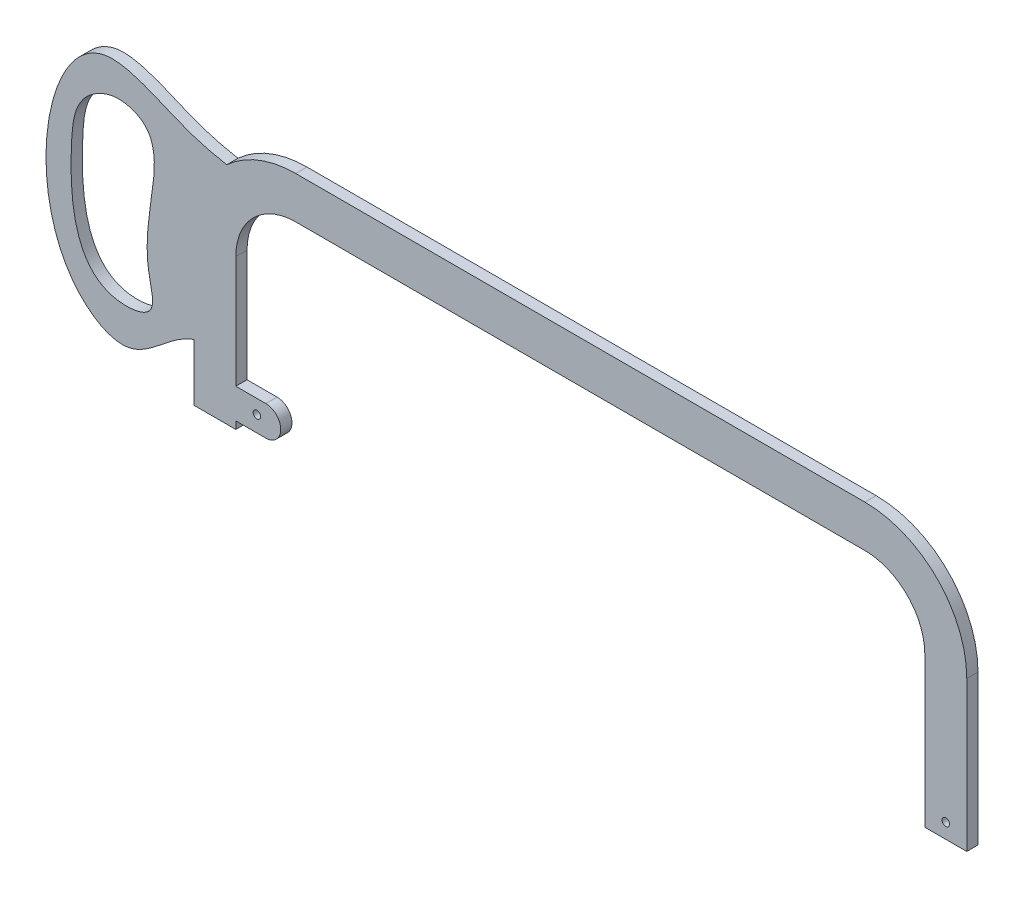
ISO-10303-21;
HEADER;
FILE_DESCRIPTION(('STEP AP214'),'2;1');
FILE_NAME('part.step','',(''),(''),'','','');
FILE_SCHEMA(('AUTOMOTIVE_DESIGN { 1 0 10303 214 1 1 1 1 }'));
ENDSEC;
DATA;
#1=APPLICATION_CONTEXT('core data for automotive mechanical design processes');
#2=APPLICATION_PROTOCOL_DEFINITION('international standard','automotive_design',2000,#1);
#3=PRODUCT_CONTEXT('',#1,'mechanical');
#4=PRODUCT('Part','Part','',(#3));
#5=PRODUCT_RELATED_PRODUCT_CATEGORY('part','',(#4));
#6=PRODUCT_DEFINITION_FORMATION('','',#4);
#7=PRODUCT_DEFINITION_CONTEXT('part definition',#1,'design');
#8=PRODUCT_DEFINITION('design','',#6,#7);
#9=PRODUCT_DEFINITION_SHAPE('','',#8);
#10=(LENGTH_UNIT() NAMED_UNIT(*) SI_UNIT(.MILLI.,.METRE.));
#11=(NAMED_UNIT(*) PLANE_ANGLE_UNIT() SI_UNIT($,.RADIAN.));
#12=(NAMED_UNIT(*) SI_UNIT($,.STERADIAN.) SOLID_ANGLE_UNIT());
#13=UNCERTAINTY_MEASURE_WITH_UNIT(LENGTH_MEASURE(1.E-05),#10,'distance_accuracy_value','');
#14=(GEOMETRIC_REPRESENTATION_CONTEXT(3) GLOBAL_UNCERTAINTY_ASSIGNED_CONTEXT((#13)) GLOBAL_UNIT_ASSIGNED_CONTEXT((#10,
#11,#12)) REPRESENTATION_CONTEXT('',''));
#15=CARTESIAN_POINT('',(0.,0.,0.));
#16=DIRECTION('',(0.,0.,1.));
#17=DIRECTION('',(1.,0.,0.));
#18=AXIS2_PLACEMENT_3D('',#15,#16,#17);
#19=CARTESIAN_POINT('',(-176.252817460317,0.,2.38125));
#20=DIRECTION('',(-1.,0.,0.));
#21=DIRECTION('',(0.,-1.,0.));
#22=AXIS2_PLACEMENT_3D('',#19,#20,#21);
#23=PLANE('',#22);
#24=DIRECTION('',(0.,1.,0.));
#25=VECTOR('',#24,1.);
#26=CARTESIAN_POINT('',(-176.252817460317,0.,-2.38125));
#27=LINE('',#26,#25);
#28=CARTESIAN_POINT('',(-176.252817460317,0.,-2.38125));
#29=VERTEX_POINT('',#28);
#30=CARTESIAN_POINT('',(-176.252817460317,3.175,-2.38125));
#31=VERTEX_POINT('',#30);
#32=EDGE_CURVE('E277',#29,#31,#27,.T.);
#33=ORIENTED_EDGE('',*,*,#32,.T.);
#34=DIRECTION('',(0.,0.,1.));
#35=VECTOR('',#34,1.);
#36=CARTESIAN_POINT('',(-176.252817460317,3.175,-25.2765005991963));
#37=LINE('',#36,#35);
#38=CARTESIAN_POINT('',(-176.252817460317,3.175,2.38125));
#39=VERTEX_POINT('',#38);
#40=EDGE_CURVE('E280',#31,#39,#37,.T.);
#41=ORIENTED_EDGE('',*,*,#40,.T.);
#42=DIRECTION('',(0.,1.,0.));
#43=VECTOR('',#42,1.);
#44=CARTESIAN_POINT('',(-176.252817460317,0.,2.38125));
#45=LINE('',#44,#43);
#46=CARTESIAN_POINT('',(-176.252817460317,0.,2.38125));
#47=VERTEX_POINT('',#46);
#48=EDGE_CURVE('E325',#47,#39,#45,.T.);
#49=ORIENTED_EDGE('',*,*,#48,.F.);
#50=DIRECTION('',(0.,0.,-1.));
#51=VECTOR('',#50,1.);
#52=CARTESIAN_POINT('',(-176.252817460317,0.,2.38125));
#53=LINE('',#52,#51);
#54=EDGE_CURVE('E11',#47,#29,#53,.T.);
#55=ORIENTED_EDGE('',*,*,#54,.T.);
#56=EDGE_LOOP('',(#33,#41,#49,#55));
#57=FACE_BOUND('',#56,.T.);
#58=ADVANCED_FACE('F32',(#57),#23,.F.);
#59=CARTESIAN_POINT('',(-194.032817460317,0.,2.38125));
#60=DIRECTION('',(0.,1.,0.));
#61=DIRECTION('',(0.,0.,1.));
#62=AXIS2_PLACEMENT_3D('',#59,#60,#61);
#63=PLANE('',#62);
#64=DIRECTION('',(1.,0.,0.));
#65=VECTOR('',#64,1.);
#66=CARTESIAN_POINT('',(-194.032817460317,0.,-2.38125));
#67=LINE('',#66,#65);
#68=CARTESIAN_POINT('',(-194.032817460317,0.,-2.38125));
#69=VERTEX_POINT('',#68);
#70=EDGE_CURVE('E160',#69,#29,#67,.T.);
#71=ORIENTED_EDGE('',*,*,#70,.T.);
#72=ORIENTED_EDGE('',*,*,#54,.F.);
#73=DIRECTION('',(1.,0.,0.));
#74=VECTOR('',#73,1.);
#75=CARTESIAN_POINT('',(-194.032817460317,0.,2.38125));
#76=LINE('',#75,#74);
#77=CARTESIAN_POINT('',(-194.032817460317,0.,2.38125));
#78=VERTEX_POINT('',#77);
#79=EDGE_CURVE('E162',#78,#47,#76,.T.);
#80=ORIENTED_EDGE('',*,*,#79,.F.);
#81=DIRECTION('',(0.,0.,-1.));
#82=VECTOR('',#81,1.);
#83=CARTESIAN_POINT('',(-194.032817460317,0.,2.38125));
#84=LINE('',#83,#82);
#85=EDGE_CURVE('E346',#78,#69,#84,.T.);
#86=ORIENTED_EDGE('',*,*,#85,.T.);
#87=EDGE_LOOP('',(#71,#72,#80,#86));
#88=FACE_BOUND('',#87,.T.);
#89=ADVANCED_FACE('F34',(#88),#63,.F.);
#90=CARTESIAN_POINT('',(-176.252817460317,15.875,2.38125));
#91=VERTEX_POINT('',#90);
#92=CARTESIAN_POINT('',(-176.252817460317,63.5,2.38125));
#93=VERTEX_POINT('',#92);
#94=EDGE_CURVE('E324',#91,#93,#45,.T.);
#95=ORIENTED_EDGE('',*,*,#94,.F.);
#96=DIRECTION('',(0.,0.,1.));
#97=VECTOR('',#96,1.);
#98=CARTESIAN_POINT('',(-176.252817460317,15.875,-25.2765005991963));
#99=LINE('',#98,#97);
#100=CARTESIAN_POINT('',(-176.252817460317,15.875,-2.38125));
#101=VERTEX_POINT('',#100);
#102=EDGE_CURVE('E297',#101,#91,#99,.T.);
#103=ORIENTED_EDGE('',*,*,#102,.F.);
#104=CARTESIAN_POINT('',(-176.252817460317,63.5,-2.38125));
#105=VERTEX_POINT('',#104);
#106=EDGE_CURVE('E284',#101,#105,#27,.T.);
#107=ORIENTED_EDGE('',*,*,#106,.T.);
#108=DIRECTION('',(0.,0.,-1.));
#109=VECTOR('',#108,1.);
#110=CARTESIAN_POINT('',(-176.252817460317,63.5,2.38125));
#111=LINE('',#110,#109);
#112=EDGE_CURVE('E40',#93,#105,#111,.T.);
#113=ORIENTED_EDGE('',*,*,#112,.F.);
#114=EDGE_LOOP('',(#95,#103,#107,#113));
#115=FACE_BOUND('',#114,.T.);
#116=ADVANCED_FACE('F265',(#115),#23,.F.);
#117=CARTESIAN_POINT('',(-150.852817460317,63.5,2.38125));
#118=DIRECTION('',(0.,0.,-1.));
#119=DIRECTION('',(-1.,0.,0.));
#120=AXIS2_PLACEMENT_3D('',#117,#118,#119);
#121=CYLINDRICAL_SURFACE('',#120,25.4);
#122=CARTESIAN_POINT('',(-150.852817460317,63.5,-2.38125));
#123=DIRECTION('',(0.,0.,-1.));
#124=DIRECTION('',(-1.,0.,0.));
#125=AXIS2_PLACEMENT_3D('',#122,#123,#124);
#126=CIRCLE('',#125,25.4);
#127=CARTESIAN_POINT('',(-150.852817460317,88.9,-2.38125));
#128=VERTEX_POINT('',#127);
#129=EDGE_CURVE('E283',#105,#128,#126,.T.);
#130=ORIENTED_EDGE('',*,*,#129,.T.);
#131=DIRECTION('',(0.,0.,-1.));
#132=VECTOR('',#131,1.);
#133=CARTESIAN_POINT('',(-150.852817460317,88.9,2.38125));
#134=LINE('',#133,#132);
#135=CARTESIAN_POINT('',(-150.852817460317,88.9,2.38125));
#136=VERTEX_POINT('',#135);
#137=EDGE_CURVE('E369',#136,#128,#134,.T.);
#138=ORIENTED_EDGE('',*,*,#137,.F.);
#139=CARTESIAN_POINT('',(-150.852817460317,63.5,2.38125));
#140=DIRECTION('',(0.,0.,-1.));
#141=DIRECTION('',(-1.,0.,0.));
#142=AXIS2_PLACEMENT_3D('',#139,#140,#141);
#143=CIRCLE('',#142,25.4);
#144=EDGE_CURVE('E327',#93,#136,#143,.T.);
#145=ORIENTED_EDGE('',*,*,#144,.F.);
#146=ORIENTED_EDGE('',*,*,#112,.T.);
#147=EDGE_LOOP('',(#130,#138,#145,#146));
#148=FACE_BOUND('',#147,.T.);
#149=ADVANCED_FACE('F262',(#148),#121,.F.);
#150=CARTESIAN_POINT('',(-150.852817460317,88.9,2.38125));
#151=DIRECTION('',(0.,1.,0.));
#152=DIRECTION('',(-1.,0.,0.));
#153=AXIS2_PLACEMENT_3D('',#150,#151,#152);
#154=PLANE('',#153);
#155=DIRECTION('',(1.,0.,0.));
#156=VECTOR('',#155,1.);
#157=CARTESIAN_POINT('',(-150.852817460317,88.9,-2.38125));
#158=LINE('',#157,#156);
#159=CARTESIAN_POINT('',(90.4471825396825,88.9,-2.38125));
#160=VERTEX_POINT('',#159);
#161=EDGE_CURVE('E307',#128,#160,#158,.T.);
#162=ORIENTED_EDGE('',*,*,#161,.T.);
#163=DIRECTION('',(0.,0.,-1.));
#164=VECTOR('',#163,1.);
#165=CARTESIAN_POINT('',(90.4471825396825,88.9,2.38125));
#166=LINE('',#165,#164);
#167=CARTESIAN_POINT('',(90.4471825396825,88.9,2.38125));
#168=VERTEX_POINT('',#167);
#169=EDGE_CURVE('E366',#168,#160,#166,.T.);
#170=ORIENTED_EDGE('',*,*,#169,.F.);
#171=DIRECTION('',(1.,0.,0.));
#172=VECTOR('',#171,1.);
#173=CARTESIAN_POINT('',(-150.852817460317,88.9,2.38125));
#174=LINE('',#173,#172);
#175=EDGE_CURVE('E329',#136,#168,#174,.T.);
#176=ORIENTED_EDGE('',*,*,#175,.F.);
#177=ORIENTED_EDGE('',*,*,#137,.T.);
#178=EDGE_LOOP('',(#162,#170,#176,#177));
#179=FACE_BOUND('',#178,.T.);
#180=ADVANCED_FACE('F258',(#179),#154,.F.);
#181=CARTESIAN_POINT('',(90.4471825396825,63.5,2.38125));
#182=DIRECTION('',(0.,0.,-1.));
#183=DIRECTION('',(-1.,0.,0.));
#184=AXIS2_PLACEMENT_3D('',#181,#182,#183);
#185=CYLINDRICAL_SURFACE('',#184,25.4);
#186=CARTESIAN_POINT('',(90.4471825396825,63.5,-2.38125));
#187=DIRECTION('',(0.,0.,-1.));
#188=DIRECTION('',(1.,0.,0.));
#189=AXIS2_PLACEMENT_3D('',#186,#187,#188);
#190=CIRCLE('',#189,25.4);
#191=CARTESIAN_POINT('',(115.847182539683,63.5,-2.38125));
#192=VERTEX_POINT('',#191);
#193=EDGE_CURVE('E309',#160,#192,#190,.T.);
#194=ORIENTED_EDGE('',*,*,#193,.T.);
#195=DIRECTION('',(0.,0.,-1.));
#196=VECTOR('',#195,1.);
#197=CARTESIAN_POINT('',(115.847182539683,63.5,2.38125));
#198=LINE('',#197,#196);
#199=CARTESIAN_POINT('',(115.847182539683,63.5,2.38125));
#200=VERTEX_POINT('',#199);
#201=EDGE_CURVE('E363',#200,#192,#198,.T.);
#202=ORIENTED_EDGE('',*,*,#201,.F.);
#203=CARTESIAN_POINT('',(90.4471825396825,63.5,2.38125));
#204=DIRECTION('',(0.,0.,-1.));
#205=DIRECTION('',(1.,0.,0.));
#206=AXIS2_PLACEMENT_3D('',#203,#204,#205);
#207=CIRCLE('',#206,25.4);
#208=EDGE_CURVE('E331',#168,#200,#207,.T.);
#209=ORIENTED_EDGE('',*,*,#208,.F.);
#210=ORIENTED_EDGE('',*,*,#169,.T.);
#211=EDGE_LOOP('',(#194,#202,#209,#210));
#212=FACE_BOUND('',#211,.T.);
#213=ADVANCED_FACE('F254',(#212),#185,.F.);
#214=CARTESIAN_POINT('',(115.847182539683,63.5,2.38125));
#215=DIRECTION('',(1.,0.,0.));
#216=DIRECTION('',(0.,0.,-1.));
#217=AXIS2_PLACEMENT_3D('',#214,#215,#216);
#218=PLANE('',#217);
#219=DIRECTION('',(0.,-1.,0.));
#220=VECTOR('',#219,1.);
#221=CARTESIAN_POINT('',(115.847182539683,63.5,-2.38125));
#222=LINE('',#221,#220);
#223=CARTESIAN_POINT('',(115.847182539683,0.,-2.38125));
#224=VERTEX_POINT('',#223);
#225=EDGE_CURVE('E311',#192,#224,#222,.T.);
#226=ORIENTED_EDGE('',*,*,#225,.T.);
#227=DIRECTION('',(0.,0.,-1.));
#228=VECTOR('',#227,1.);
#229=CARTESIAN_POINT('',(115.847182539683,0.,2.38125));
#230=LINE('',#229,#228);
#231=CARTESIAN_POINT('',(115.847182539683,0.,2.38125));
#232=VERTEX_POINT('',#231);
#233=EDGE_CURVE('E360',#232,#224,#230,.T.);
#234=ORIENTED_EDGE('',*,*,#233,.F.);
#235=DIRECTION('',(0.,-1.,0.));
#236=VECTOR('',#235,1.);
#237=CARTESIAN_POINT('',(115.847182539683,63.5,2.38125));
#238=LINE('',#237,#236);
#239=EDGE_CURVE('E333',#200,#232,#238,.T.);
#240=ORIENTED_EDGE('',*,*,#239,.F.);
#241=ORIENTED_EDGE('',*,*,#201,.T.);
#242=EDGE_LOOP('',(#226,#234,#240,#241));
#243=FACE_BOUND('',#242,.T.);
#244=ADVANCED_FACE('F250',(#243),#218,.F.);
#245=CARTESIAN_POINT('',(115.847182539683,0.,2.38125));
#246=DIRECTION('',(0.,1.,0.));
#247=DIRECTION('',(0.,0.,1.));
#248=AXIS2_PLACEMENT_3D('',#245,#246,#247);
#249=PLANE('',#248);
#250=DIRECTION('',(1.,0.,0.));
#251=VECTOR('',#250,1.);
#252=CARTESIAN_POINT('',(115.847182539683,0.,-2.38125));
#253=LINE('',#252,#251);
#254=CARTESIAN_POINT('',(133.627182539683,0.,-2.38125));
#255=VERTEX_POINT('',#254);
#256=EDGE_CURVE('E313',#224,#255,#253,.T.);
#257=ORIENTED_EDGE('',*,*,#256,.T.);
#258=DIRECTION('',(0.,0.,-1.));
#259=VECTOR('',#258,1.);
#260=CARTESIAN_POINT('',(133.627182539683,0.,2.38125));
#261=LINE('',#260,#259);
#262=CARTESIAN_POINT('',(133.627182539683,0.,2.38125));
#263=VERTEX_POINT('',#262);
#264=EDGE_CURVE('E357',#263,#255,#261,.T.);
#265=ORIENTED_EDGE('',*,*,#264,.F.);
#266=DIRECTION('',(1.,0.,0.));
#267=VECTOR('',#266,1.);
#268=CARTESIAN_POINT('',(115.847182539683,0.,2.38125));
#269=LINE('',#268,#267);
#270=EDGE_CURVE('E335',#232,#263,#269,.T.);
#271=ORIENTED_EDGE('',*,*,#270,.F.);
#272=ORIENTED_EDGE('',*,*,#233,.T.);
#273=EDGE_LOOP('',(#257,#265,#271,#272));
#274=FACE_BOUND('',#273,.T.);
#275=ADVANCED_FACE('F246',(#274),#249,.F.);
#276=CARTESIAN_POINT('',(133.627182539683,0.,2.38125));
#277=DIRECTION('',(-1.,0.,0.));
#278=DIRECTION('',(0.,0.,1.));
#279=AXIS2_PLACEMENT_3D('',#276,#277,#278);
#280=PLANE('',#279);
#281=DIRECTION('',(0.,1.,0.));
#282=VECTOR('',#281,1.);
#283=CARTESIAN_POINT('',(133.627182539683,0.,-2.38125));
#284=LINE('',#283,#282);
#285=CARTESIAN_POINT('',(133.627182539683,63.5,-2.38125));
#286=VERTEX_POINT('',#285);
#287=EDGE_CURVE('E315',#255,#286,#284,.T.);
#288=ORIENTED_EDGE('',*,*,#287,.T.);
#289=DIRECTION('',(0.,0.,-1.));
#290=VECTOR('',#289,1.);
#291=CARTESIAN_POINT('',(133.627182539683,63.5,2.38125));
#292=LINE('',#291,#290);
#293=CARTESIAN_POINT('',(133.627182539683,63.5,2.38125));
#294=VERTEX_POINT('',#293);
#295=EDGE_CURVE('E354',#294,#286,#292,.T.);
#296=ORIENTED_EDGE('',*,*,#295,.F.);
#297=DIRECTION('',(0.,1.,0.));
#298=VECTOR('',#297,1.);
#299=CARTESIAN_POINT('',(133.627182539683,0.,2.38125));
#300=LINE('',#299,#298);
#301=EDGE_CURVE('E337',#263,#294,#300,.T.);
#302=ORIENTED_EDGE('',*,*,#301,.F.);
#303=ORIENTED_EDGE('',*,*,#264,.T.);
#304=EDGE_LOOP('',(#288,#296,#302,#303));
#305=FACE_BOUND('',#304,.T.);
#306=ADVANCED_FACE('F242',(#305),#280,.F.);
#307=CARTESIAN_POINT('',(90.4471825396825,63.5,2.38125));
#308=DIRECTION('',(0.,0.,-1.));
#309=DIRECTION('',(-1.,0.,0.));
#310=AXIS2_PLACEMENT_3D('',#307,#308,#309);
#311=CYLINDRICAL_SURFACE('',#310,43.18);
#312=CARTESIAN_POINT('',(90.4471825396825,63.5,-2.38125));
#313=DIRECTION('',(0.,0.,1.));
#314=DIRECTION('',(1.,0.,0.));
#315=AXIS2_PLACEMENT_3D('',#312,#313,#314);
#316=CIRCLE('',#315,43.18);
#317=CARTESIAN_POINT('',(90.4471825396825,106.68,-2.38125));
#318=VERTEX_POINT('',#317);
#319=EDGE_CURVE('E317',#286,#318,#316,.T.);
#320=ORIENTED_EDGE('',*,*,#319,.T.);
#321=DIRECTION('',(0.,0.,-1.));
#322=VECTOR('',#321,1.);
#323=CARTESIAN_POINT('',(90.4471825396825,106.68,2.38125));
#324=LINE('',#323,#322);
#325=CARTESIAN_POINT('',(90.4471825396825,106.68,2.38125));
#326=VERTEX_POINT('',#325);
#327=EDGE_CURVE('E351',#326,#318,#324,.T.);
#328=ORIENTED_EDGE('',*,*,#327,.F.);
#329=CARTESIAN_POINT('',(90.4471825396825,63.5,2.38125));
#330=DIRECTION('',(0.,0.,1.));
#331=DIRECTION('',(1.,0.,0.));
#332=AXIS2_PLACEMENT_3D('',#329,#330,#331);
#333=CIRCLE('',#332,43.18);
#334=EDGE_CURVE('E339',#294,#326,#333,.T.);
#335=ORIENTED_EDGE('',*,*,#334,.F.);
#336=ORIENTED_EDGE('',*,*,#295,.T.);
#337=EDGE_LOOP('',(#320,#328,#335,#336));
#338=FACE_BOUND('',#337,.T.);
#339=ADVANCED_FACE('F238',(#338),#311,.T.);
#340=CARTESIAN_POINT('',(90.4471825396825,106.68,2.38125));
#341=DIRECTION('',(0.,-1.,0.));
#342=DIRECTION('',(1.,0.,0.));
#343=AXIS2_PLACEMENT_3D('',#340,#341,#342);
#344=PLANE('',#343);
#345=DIRECTION('',(-1.,0.,0.));
#346=VECTOR('',#345,1.);
#347=CARTESIAN_POINT('',(90.4471825396825,106.68,-2.38125));
#348=LINE('',#347,#346);
#349=CARTESIAN_POINT('',(-150.852817460317,106.68,-2.38125));
#350=VERTEX_POINT('',#349);
#351=EDGE_CURVE('E319',#318,#350,#348,.T.);
#352=ORIENTED_EDGE('',*,*,#351,.T.);
#353=DIRECTION('',(0.,0.,-1.));
#354=VECTOR('',#353,1.);
#355=CARTESIAN_POINT('',(-150.852817460317,106.68,2.38125));
#356=LINE('',#355,#354);
#357=CARTESIAN_POINT('',(-150.852817460317,106.68,2.38125));
#358=VERTEX_POINT('',#357);
#359=EDGE_CURVE('E348',#358,#350,#356,.T.);
#360=ORIENTED_EDGE('',*,*,#359,.F.);
#361=DIRECTION('',(-1.,0.,0.));
#362=VECTOR('',#361,1.);
#363=CARTESIAN_POINT('',(90.4471825396825,106.68,2.38125));
#364=LINE('',#363,#362);
#365=EDGE_CURVE('E341',#326,#358,#364,.T.);
#366=ORIENTED_EDGE('',*,*,#365,.F.);
#367=ORIENTED_EDGE('',*,*,#327,.T.);
#368=EDGE_LOOP('',(#352,#360,#366,#367));
#369=FACE_BOUND('',#368,.T.);
#370=ADVANCED_FACE('F235',(#369),#344,.F.);
#371=CARTESIAN_POINT('',(-150.852817460317,63.5,2.38125));
#372=DIRECTION('',(0.,0.,-1.));
#373=DIRECTION('',(-1.,0.,0.));
#374=AXIS2_PLACEMENT_3D('',#371,#372,#373);
#375=CYLINDRICAL_SURFACE('',#374,43.18);
#376=CARTESIAN_POINT('',(-150.852817460317,63.5,-2.38125));
#377=DIRECTION('',(0.,0.,1.));
#378=DIRECTION('',(-1.,0.,0.));
#379=AXIS2_PLACEMENT_3D('',#376,#377,#378);
#380=CIRCLE('',#379,43.18);
#381=CARTESIAN_POINT('',(-180.094894680852,95.2712656315155,-2.38125));
#382=VERTEX_POINT('',#381);
#383=EDGE_CURVE('E163',#350,#382,#380,.T.);
#384=ORIENTED_EDGE('',*,*,#383,.T.);
#385=DIRECTION('',(0.,0.,1.));
#386=VECTOR('',#385,1.);
#387=CARTESIAN_POINT('',(-180.094894680852,95.2712656315155,0.));
#388=LINE('',#387,#386);
#389=CARTESIAN_POINT('',(-180.094894680852,95.2712656315155,2.38125));
#390=VERTEX_POINT('',#389);
#391=EDGE_CURVE('E55',#382,#390,#388,.T.);
#392=ORIENTED_EDGE('',*,*,#391,.T.);
#393=CARTESIAN_POINT('',(-150.852817460317,63.5,2.38125));
#394=DIRECTION('',(0.,0.,1.));
#395=DIRECTION('',(-1.,0.,0.));
#396=AXIS2_PLACEMENT_3D('',#393,#394,#395);
#397=CIRCLE('',#396,43.18);
#398=EDGE_CURVE('E343',#358,#390,#397,.T.);
#399=ORIENTED_EDGE('',*,*,#398,.F.);
#400=ORIENTED_EDGE('',*,*,#359,.T.);
#401=EDGE_LOOP('',(#384,#392,#399,#400));
#402=FACE_BOUND('',#401,.T.);
#403=ADVANCED_FACE('F232',(#402),#375,.T.);
#404=CARTESIAN_POINT('',(-194.032817460317,63.5,2.38125));
#405=DIRECTION('',(1.,0.,0.));
#406=DIRECTION('',(0.,1.,0.));
#407=AXIS2_PLACEMENT_3D('',#404,#405,#406);
#408=PLANE('',#407);
#409=DIRECTION('',(0.,-1.,0.));
#410=VECTOR('',#409,1.);
#411=CARTESIAN_POINT('',(-194.032817460317,63.5,2.38125));
#412=LINE('',#411,#410);
#413=CARTESIAN_POINT('',(-194.032817460317,24.1205061199108,2.38125));
#414=VERTEX_POINT('',#413);
#415=EDGE_CURVE('E47',#414,#78,#412,.T.);
#416=ORIENTED_EDGE('',*,*,#415,.F.);
#417=DIRECTION('',(0.,0.,1.));
#418=VECTOR('',#417,1.);
#419=CARTESIAN_POINT('',(-194.032817460317,24.1205061199112,0.));
#420=LINE('',#419,#418);
#421=CARTESIAN_POINT('',(-194.032817460319,24.1205061199108,-2.38125));
#422=VERTEX_POINT('',#421);
#423=EDGE_CURVE('E165',#414,#422,#420,.F.);
#424=ORIENTED_EDGE('',*,*,#423,.T.);
#425=DIRECTION('',(0.,-1.,0.));
#426=VECTOR('',#425,1.);
#427=CARTESIAN_POINT('',(-194.032817460317,63.5,-2.38125));
#428=LINE('',#427,#426);
#429=EDGE_CURVE('E153',#422,#69,#428,.T.);
#430=ORIENTED_EDGE('',*,*,#429,.T.);
#431=ORIENTED_EDGE('',*,*,#85,.F.);
#432=EDGE_LOOP('',(#416,#424,#430,#431));
#433=FACE_BOUND('',#432,.T.);
#434=ADVANCED_FACE('F166',(#433),#408,.F.);
#435=CARTESIAN_POINT('',(-150.852817460317,63.5,2.38125));
#436=DIRECTION('',(0.,0.,-1.));
#437=DIRECTION('',(-1.,0.,0.));
#438=AXIS2_PLACEMENT_3D('',#435,#436,#437);
#439=PLANE('',#438);
#440=ORIENTED_EDGE('',*,*,#398,.T.);
#441=CARTESIAN_POINT('',(-163.50008603373,92.9767178813179,2.38125));
#442=CARTESIAN_POINT('',(-174.215818284095,94.2300992189467,2.38125));
#443=CARTESIAN_POINT('',(-196.776448036714,96.8689363638482,2.38125));
#444=CARTESIAN_POINT('',(-252.859222163881,130.124714633944,2.38125));
#445=CARTESIAN_POINT('',(-269.426470803475,29.793267068146,2.38125));
#446=CARTESIAN_POINT('',(-217.090656666542,-1.29085573981712,2.38125));
#447=CARTESIAN_POINT('',(-200.757769768453,26.3378115151783,2.38125));
#448=CARTESIAN_POINT('',(-186.899721404846,24.7198097405488,2.38125));
#449=CARTESIAN_POINT('',(-185.37100561647,24.541323939836,2.38125));
#450=B_SPLINE_CURVE_WITH_KNOTS('',3,(#441,#442,#443,#444,#445,#446,#447,#448,#449),
.UNSPECIFIED.,.F.,.F.,(4,1,1,1,1,1,4),(0.,0.145421676533469,0.306167093916027,0.711218283048218,
0.818840041352885,0.980015794306756,1.),.UNSPECIFIED.);
#451=EDGE_CURVE('E176',#390,#414,#450,.T.);
#452=ORIENTED_EDGE('',*,*,#451,.T.);
#453=ORIENTED_EDGE('',*,*,#415,.T.);
#454=ORIENTED_EDGE('',*,*,#79,.T.);
#455=ORIENTED_EDGE('',*,*,#48,.T.);
#456=DIRECTION('',(1.,0.,0.));
#457=VECTOR('',#456,1.);
#458=CARTESIAN_POINT('',(-176.252817460317,3.175,2.38125));
#459=LINE('',#458,#457);
#460=CARTESIAN_POINT('',(-163.552817460317,3.175,2.38125));
#461=VERTEX_POINT('',#460);
#462=EDGE_CURVE('E296',#39,#461,#459,.T.);
#463=ORIENTED_EDGE('',*,*,#462,.T.);
#464=CARTESIAN_POINT('',(-163.552817460317,9.525,2.38125));
#465=DIRECTION('',(0.,0.,1.));
#466=DIRECTION('',(1.,0.,0.));
#467=AXIS2_PLACEMENT_3D('',#464,#465,#466);
#468=CIRCLE('',#467,6.35);
#469=CARTESIAN_POINT('',(-163.552817460317,15.875,2.38125));
#470=VERTEX_POINT('',#469);
#471=EDGE_CURVE('E397',#461,#470,#468,.T.);
#472=ORIENTED_EDGE('',*,*,#471,.T.);
#473=DIRECTION('',(-1.,0.,0.));
#474=VECTOR('',#473,1.);
#475=CARTESIAN_POINT('',(-176.252817460317,15.875,2.38125));
#476=LINE('',#475,#474);
#477=EDGE_CURVE('E292',#470,#91,#476,.T.);
#478=ORIENTED_EDGE('',*,*,#477,.T.);
#479=ORIENTED_EDGE('',*,*,#94,.T.);
#480=ORIENTED_EDGE('',*,*,#144,.T.);
#481=ORIENTED_EDGE('',*,*,#175,.T.);
#482=ORIENTED_EDGE('',*,*,#208,.T.);
#483=ORIENTED_EDGE('',*,*,#239,.T.);
#484=ORIENTED_EDGE('',*,*,#270,.T.);
#485=ORIENTED_EDGE('',*,*,#301,.T.);
#486=ORIENTED_EDGE('',*,*,#334,.T.);
#487=ORIENTED_EDGE('',*,*,#365,.T.);
#488=EDGE_LOOP('',(#440,#452,#453,#454,#455,#463,#472,#478,#479,#480,#481,#482,#483,#484,#485,
#486,#487));
#489=FACE_BOUND('',#488,.T.);
#490=CARTESIAN_POINT('',(124.737182539683,6.35,2.38125));
#491=DIRECTION('',(0.,0.,1.));
#492=DIRECTION('',(1.,0.,0.));
#493=AXIS2_PLACEMENT_3D('',#490,#491,#492);
#494=CIRCLE('',#493,1.58749999999997);
#495=CARTESIAN_POINT('',(126.324682539683,6.35,2.38125));
#496=VERTEX_POINT('',#495);
#497=EDGE_CURVE('E410',#496,#496,#494,.T.);
#498=ORIENTED_EDGE('',*,*,#497,.F.);
#499=EDGE_LOOP('',(#498));
#500=FACE_BOUND('',#499,.T.);
#501=CARTESIAN_POINT('',(-167.336278270076,9.93855216538009,2.38125));
#502=DIRECTION('',(0.,0.,1.));
#503=DIRECTION('',(1.,0.,0.));
#504=AXIS2_PLACEMENT_3D('',#501,#502,#503);
#505=CIRCLE('',#504,1.58749999999999);
#506=CARTESIAN_POINT('',(-165.748778270076,9.93855216538009,2.38125));
#507=VERTEX_POINT('',#506);
#508=EDGE_CURVE('E401',#507,#507,#505,.T.);
#509=ORIENTED_EDGE('',*,*,#508,.F.);
#510=EDGE_LOOP('',(#509));
#511=FACE_BOUND('',#510,.T.);
#512=CARTESIAN_POINT('',(-241.011953679969,88.8094623745175,2.38125));
#513=CARTESIAN_POINT('',(-244.988611476123,83.6487410239102,2.38125));
#514=CARTESIAN_POINT('',(-247.283551881555,60.1055409584341,2.38125));
#515=CARTESIAN_POINT('',(-244.915722390433,18.8537352838272,2.38125));
#516=CARTESIAN_POINT('',(-208.081682807615,23.1237234693048,2.38125));
#517=CARTESIAN_POINT('',(-220.297957576784,55.3931547391515,2.38125));
#518=CARTESIAN_POINT('',(-201.095560901441,90.7405361068269,2.38125));
#519=CARTESIAN_POINT('',(-229.023756485265,98.1268585883008,2.38125));
#520=CARTESIAN_POINT('',(-237.642234652288,93.1825268480365,2.38125));
#521=CARTESIAN_POINT('',(-241.011953679969,88.8094623745175,2.38125));
#522=B_SPLINE_CURVE_WITH_KNOTS('',3,(#512,#513,#514,#515,#516,#517,#518,#519,#520,#521),
.UNSPECIFIED.,.T.,.F.,(4,1,1,1,1,1,1,4),(0.,0.110817881329757,0.392381603405073,
0.47396519666166,0.559095552804665,0.859488043987518,0.906095736051165,1.),.UNSPECIFIED.);
#523=CARTESIAN_POINT('',(-241.011953679969,88.8094623745175,2.38125));
#524=VERTEX_POINT('',#523);
#525=EDGE_CURVE('E173',#524,#524,#522,.T.);
#526=ORIENTED_EDGE('',*,*,#525,.F.);
#527=EDGE_LOOP('',(#526));
#528=FACE_BOUND('',#527,.T.);
#529=ADVANCED_FACE('F226',(#489,#500,#511,#528),#439,.F.);
#530=CARTESIAN_POINT('',(-150.852817460317,63.5,-2.38125));
#531=DIRECTION('',(0.,0.,-1.));
#532=DIRECTION('',(-1.,0.,0.));
#533=AXIS2_PLACEMENT_3D('',#530,#531,#532);
#534=PLANE('',#533);
#535=ORIENTED_EDGE('',*,*,#429,.F.);
#536=CARTESIAN_POINT('',(-163.50008603373,92.9767178813179,-2.38125));
#537=CARTESIAN_POINT('',(-174.215818284095,94.2300992189467,-2.38125));
#538=CARTESIAN_POINT('',(-196.776448036714,96.8689363638482,-2.38125));
#539=CARTESIAN_POINT('',(-252.859222163881,130.124714633944,-2.38125));
#540=CARTESIAN_POINT('',(-269.426470803475,29.793267068146,-2.38125));
#541=CARTESIAN_POINT('',(-217.090656666542,-1.29085573981712,-2.38125));
#542=CARTESIAN_POINT('',(-200.757769768453,26.3378115151783,-2.38125));
#543=CARTESIAN_POINT('',(-186.899721404846,24.7198097405488,-2.38125));
#544=CARTESIAN_POINT('',(-185.37100561647,24.541323939836,-2.38125));
#545=B_SPLINE_CURVE_WITH_KNOTS('',3,(#536,#537,#538,#539,#540,#541,#542,#543,#544),
.UNSPECIFIED.,.F.,.F.,(4,1,1,1,1,1,4),(0.,0.145421676533469,0.306167093916027,0.711218283048218,
0.818840041352885,0.980015794306756,1.),.UNSPECIFIED.);
#546=EDGE_CURVE('E158',#382,#422,#545,.T.);
#547=ORIENTED_EDGE('',*,*,#546,.F.);
#548=ORIENTED_EDGE('',*,*,#383,.F.);
#549=ORIENTED_EDGE('',*,*,#351,.F.);
#550=ORIENTED_EDGE('',*,*,#319,.F.);
#551=ORIENTED_EDGE('',*,*,#287,.F.);
#552=ORIENTED_EDGE('',*,*,#256,.F.);
#553=ORIENTED_EDGE('',*,*,#225,.F.);
#554=ORIENTED_EDGE('',*,*,#193,.F.);
#555=ORIENTED_EDGE('',*,*,#161,.F.);
#556=ORIENTED_EDGE('',*,*,#129,.F.);
#557=ORIENTED_EDGE('',*,*,#106,.F.);
#558=DIRECTION('',(-1.,0.,0.));
#559=VECTOR('',#558,1.);
#560=CARTESIAN_POINT('',(-176.252817460317,15.875,-2.38125));
#561=LINE('',#560,#559);
#562=CARTESIAN_POINT('',(-163.552817460317,15.875,-2.38125));
#563=VERTEX_POINT('',#562);
#564=EDGE_CURVE('E301',#563,#101,#561,.T.);
#565=ORIENTED_EDGE('',*,*,#564,.F.);
#566=CARTESIAN_POINT('',(-163.552817460317,9.525,-2.38125));
#567=DIRECTION('',(0.,0.,-1.));
#568=DIRECTION('',(-1.,0.,0.));
#569=AXIS2_PLACEMENT_3D('',#566,#567,#568);
#570=CIRCLE('',#569,6.35);
#571=CARTESIAN_POINT('',(-163.552817460317,3.175,-2.38125));
#572=VERTEX_POINT('',#571);
#573=EDGE_CURVE('E289',#572,#563,#570,.F.);
#574=ORIENTED_EDGE('',*,*,#573,.F.);
#575=DIRECTION('',(1.,0.,0.));
#576=VECTOR('',#575,1.);
#577=CARTESIAN_POINT('',(-176.252817460317,3.175,-2.38125));
#578=LINE('',#577,#576);
#579=EDGE_CURVE('E287',#31,#572,#578,.T.);
#580=ORIENTED_EDGE('',*,*,#579,.F.);
#581=ORIENTED_EDGE('',*,*,#32,.F.);
#582=ORIENTED_EDGE('',*,*,#70,.F.);
#583=EDGE_LOOP('',(#535,#547,#548,#549,#550,#551,#552,#553,#554,#555,#556,#557,#565,#574,#580,
#581,#582));
#584=FACE_BOUND('',#583,.T.);
#585=CARTESIAN_POINT('',(124.737182539683,6.35,-2.38125));
#586=DIRECTION('',(0.,0.,1.));
#587=DIRECTION('',(1.,0.,0.));
#588=AXIS2_PLACEMENT_3D('',#585,#586,#587);
#589=CIRCLE('',#588,1.58749999999997);
#590=CARTESIAN_POINT('',(126.324682539683,6.35,-2.38125));
#591=VERTEX_POINT('',#590);
#592=EDGE_CURVE('E407',#591,#591,#589,.T.);
#593=ORIENTED_EDGE('',*,*,#592,.T.);
#594=EDGE_LOOP('',(#593));
#595=FACE_BOUND('',#594,.T.);
#596=CARTESIAN_POINT('',(-167.336278270076,9.93855216538009,-2.38125));
#597=DIRECTION('',(0.,0.,1.));
#598=DIRECTION('',(1.,0.,0.));
#599=AXIS2_PLACEMENT_3D('',#596,#597,#598);
#600=CIRCLE('',#599,1.58749999999999);
#601=CARTESIAN_POINT('',(-165.748778270076,9.93855216538009,-2.38125));
#602=VERTEX_POINT('',#601);
#603=EDGE_CURVE('E399',#602,#602,#600,.T.);
#604=ORIENTED_EDGE('',*,*,#603,.T.);
#605=EDGE_LOOP('',(#604));
#606=FACE_BOUND('',#605,.T.);
#607=CARTESIAN_POINT('',(-241.011953679969,88.8094623745175,-2.38125));
#608=CARTESIAN_POINT('',(-244.988611476123,83.6487410239102,-2.38125));
#609=CARTESIAN_POINT('',(-247.283551881555,60.1055409584341,-2.38125));
#610=CARTESIAN_POINT('',(-244.915722390433,18.8537352838272,-2.38125));
#611=CARTESIAN_POINT('',(-208.081682807615,23.1237234693048,-2.38125));
#612=CARTESIAN_POINT('',(-220.297957576784,55.3931547391515,-2.38125));
#613=CARTESIAN_POINT('',(-201.095560901441,90.7405361068269,-2.38125));
#614=CARTESIAN_POINT('',(-229.023756485265,98.1268585883008,-2.38125));
#615=CARTESIAN_POINT('',(-237.642234652288,93.1825268480365,-2.38125));
#616=CARTESIAN_POINT('',(-241.011953679969,88.8094623745175,-2.38125));
#617=B_SPLINE_CURVE_WITH_KNOTS('',3,(#607,#608,#609,#610,#611,#612,#613,#614,#615,#616),
.UNSPECIFIED.,.T.,.F.,(4,1,1,1,1,1,1,4),(0.,0.110817881329757,0.392381603405073,
0.47396519666166,0.559095552804665,0.859488043987518,0.906095736051165,1.),.UNSPECIFIED.);
#618=CARTESIAN_POINT('',(-241.011953679969,88.8094623745175,-2.38125));
#619=VERTEX_POINT('',#618);
#620=EDGE_CURVE('E170',#619,#619,#617,.T.);
#621=ORIENTED_EDGE('',*,*,#620,.T.);
#622=EDGE_LOOP('',(#621));
#623=FACE_BOUND('',#622,.T.);
#624=ADVANCED_FACE('F154',(#584,#595,#606,#623),#534,.T.);
#625=CARTESIAN_POINT('',(-176.252817460317,3.175,-25.2765005991963));
#626=DIRECTION('',(0.,-1.,0.));
#627=DIRECTION('',(0.,0.,-1.));
#628=AXIS2_PLACEMENT_3D('',#625,#626,#627);
#629=PLANE('',#628);
#630=ORIENTED_EDGE('',*,*,#40,.F.);
#631=ORIENTED_EDGE('',*,*,#579,.T.);
#632=DIRECTION('',(0.,0.,1.));
#633=VECTOR('',#632,1.);
#634=CARTESIAN_POINT('',(-163.552817460317,3.175,-25.2765005991963));
#635=LINE('',#634,#633);
#636=EDGE_CURVE('E291',#572,#461,#635,.T.);
#637=ORIENTED_EDGE('',*,*,#636,.T.);
#638=ORIENTED_EDGE('',*,*,#462,.F.);
#639=EDGE_LOOP('',(#630,#631,#637,#638));
#640=FACE_BOUND('',#639,.T.);
#641=ADVANCED_FACE('F219',(#640),#629,.T.);
#642=CARTESIAN_POINT('',(-163.552817460317,9.525,-25.2765005991963));
#643=DIRECTION('',(0.,0.,1.));
#644=DIRECTION('',(1.,0.,0.));
#645=AXIS2_PLACEMENT_3D('',#642,#643,#644);
#646=CYLINDRICAL_SURFACE('',#645,6.35);
#647=ORIENTED_EDGE('',*,*,#636,.F.);
#648=ORIENTED_EDGE('',*,*,#573,.T.);
#649=DIRECTION('',(0.,0.,1.));
#650=VECTOR('',#649,1.);
#651=CARTESIAN_POINT('',(-163.552817460317,15.875,-25.2765005991963));
#652=LINE('',#651,#650);
#653=EDGE_CURVE('E392',#563,#470,#652,.T.);
#654=ORIENTED_EDGE('',*,*,#653,.T.);
#655=ORIENTED_EDGE('',*,*,#471,.F.);
#656=EDGE_LOOP('',(#647,#648,#654,#655));
#657=FACE_BOUND('',#656,.T.);
#658=ADVANCED_FACE('F215',(#657),#646,.T.);
#659=CARTESIAN_POINT('',(-176.252817460317,15.875,-25.2765005991963));
#660=DIRECTION('',(0.,1.,0.));
#661=DIRECTION('',(0.,0.,1.));
#662=AXIS2_PLACEMENT_3D('',#659,#660,#661);
#663=PLANE('',#662);
#664=ORIENTED_EDGE('',*,*,#653,.F.);
#665=ORIENTED_EDGE('',*,*,#564,.T.);
#666=ORIENTED_EDGE('',*,*,#102,.T.);
#667=ORIENTED_EDGE('',*,*,#477,.F.);
#668=EDGE_LOOP('',(#664,#665,#666,#667));
#669=FACE_BOUND('',#668,.T.);
#670=ADVANCED_FACE('F211',(#669),#663,.T.);
#671=CARTESIAN_POINT('',(-167.336278270076,9.93855216538009,-2.38125));
#672=DIRECTION('',(0.,0.,1.));
#673=DIRECTION('',(1.,0.,0.));
#674=AXIS2_PLACEMENT_3D('',#671,#672,#673);
#675=CYLINDRICAL_SURFACE('',#674,1.58749999999999);
#676=ORIENTED_EDGE('',*,*,#603,.F.);
#677=EDGE_LOOP('',(#676));
#678=FACE_BOUND('',#677,.T.);
#679=ORIENTED_EDGE('',*,*,#508,.T.);
#680=EDGE_LOOP('',(#679));
#681=FACE_BOUND('',#680,.T.);
#682=ADVANCED_FACE('F207',(#678,#681),#675,.F.);
#683=CARTESIAN_POINT('',(124.737182539683,6.35,-2.38125));
#684=DIRECTION('',(0.,0.,1.));
#685=DIRECTION('',(1.,0.,0.));
#686=AXIS2_PLACEMENT_3D('',#683,#684,#685);
#687=CYLINDRICAL_SURFACE('',#686,1.58749999999997);
#688=ORIENTED_EDGE('',*,*,#592,.F.);
#689=EDGE_LOOP('',(#688));
#690=FACE_BOUND('',#689,.T.);
#691=ORIENTED_EDGE('',*,*,#497,.T.);
#692=EDGE_LOOP('',(#691));
#693=FACE_BOUND('',#692,.T.);
#694=ADVANCED_FACE('F201',(#690,#693),#687,.F.);
#695=CARTESIAN_POINT('',(-163.50008603373,92.9767178813179,-143.124890978681));
#696=CARTESIAN_POINT('',(-174.215818284095,94.2300992189467,-143.124890978681));
#697=CARTESIAN_POINT('',(-196.776448036714,96.8689363638482,-143.124890978681));
#698=CARTESIAN_POINT('',(-252.859222163881,130.124714633944,-143.124890978681));
#699=CARTESIAN_POINT('',(-269.426470803475,29.793267068146,-143.124890978681));
#700=CARTESIAN_POINT('',(-217.090656666542,-1.29085573981712,-143.124890978681));
#701=CARTESIAN_POINT('',(-200.757769768453,26.3378115151783,-143.124890978681));
#702=CARTESIAN_POINT('',(-186.899721404846,24.7198097405488,-143.124890978681));
#703=CARTESIAN_POINT('',(-185.37100561647,24.541323939836,-143.124890978681));
#704=B_SPLINE_CURVE_WITH_KNOTS('',3,(#695,#696,#697,#698,#699,#700,#701,#702,#703),
.UNSPECIFIED.,.F.,.F.,(4,1,1,1,1,1,4),(0.,0.145421676533469,0.306167093916027,0.711218283048218,
0.818840041352885,0.980015794306756,1.),.UNSPECIFIED.);
#705=DIRECTION('',(0.,0.,1.));
#706=VECTOR('',#705,1.);
#707=SURFACE_OF_LINEAR_EXTRUSION('',#704,#706);
#708=ORIENTED_EDGE('',*,*,#391,.F.);
#709=ORIENTED_EDGE('',*,*,#546,.T.);
#710=ORIENTED_EDGE('',*,*,#423,.F.);
#711=ORIENTED_EDGE('',*,*,#451,.F.);
#712=EDGE_LOOP('',(#708,#709,#710,#711));
#713=FACE_BOUND('',#712,.T.);
#714=ADVANCED_FACE('F172',(#713),#707,.T.);
#715=CARTESIAN_POINT('',(-241.011953679969,88.8094623745175,-143.124890978681));
#716=CARTESIAN_POINT('',(-244.988611476123,83.6487410239102,-143.124890978681));
#717=CARTESIAN_POINT('',(-247.283551881555,60.1055409584341,-143.124890978681));
#718=CARTESIAN_POINT('',(-244.915722390433,18.8537352838272,-143.124890978681));
#719=CARTESIAN_POINT('',(-208.081682807615,23.1237234693048,-143.124890978681));
#720=CARTESIAN_POINT('',(-220.297957576784,55.3931547391515,-143.124890978681));
#721=CARTESIAN_POINT('',(-201.095560901441,90.7405361068269,-143.124890978681));
#722=CARTESIAN_POINT('',(-229.023756485265,98.1268585883008,-143.124890978681));
#723=CARTESIAN_POINT('',(-237.642234652288,93.1825268480365,-143.124890978681));
#724=CARTESIAN_POINT('',(-241.011953679969,88.8094623745175,-143.124890978681));
#725=B_SPLINE_CURVE_WITH_KNOTS('',3,(#715,#716,#717,#718,#719,#720,#721,#722,#723,#724),
.UNSPECIFIED.,.T.,.F.,(4,1,1,1,1,1,1,4),(0.,0.110817881329757,0.392381603405073,
0.47396519666166,0.559095552804665,0.859488043987518,0.906095736051165,1.),.UNSPECIFIED.);
#726=DIRECTION('',(0.,0.,1.));
#727=VECTOR('',#726,1.);
#728=SURFACE_OF_LINEAR_EXTRUSION('',#725,#727);
#729=ORIENTED_EDGE('',*,*,#525,.T.);
#730=EDGE_LOOP('',(#729));
#731=FACE_BOUND('',#730,.T.);
#732=ORIENTED_EDGE('',*,*,#620,.F.);
#733=EDGE_LOOP('',(#732));
#734=FACE_BOUND('',#733,.T.);
#735=ADVANCED_FACE('F200',(#731,#734),#728,.F.);
#736=CLOSED_SHELL('',(#58,#89,#116,#149,#180,#213,#244,#275,#306,#339,#370,#403,#434,#529,#624,
#641,#658,#670,#682,#694,#714,#735));
#737=MANIFOLD_SOLID_BREP('B2',#736);
#738=ADVANCED_BREP_SHAPE_REPRESENTATION('',(#18,#737),#14);
#739=SHAPE_DEFINITION_REPRESENTATION(#9,#738);
ENDSEC;
END-ISO-10303-21;
